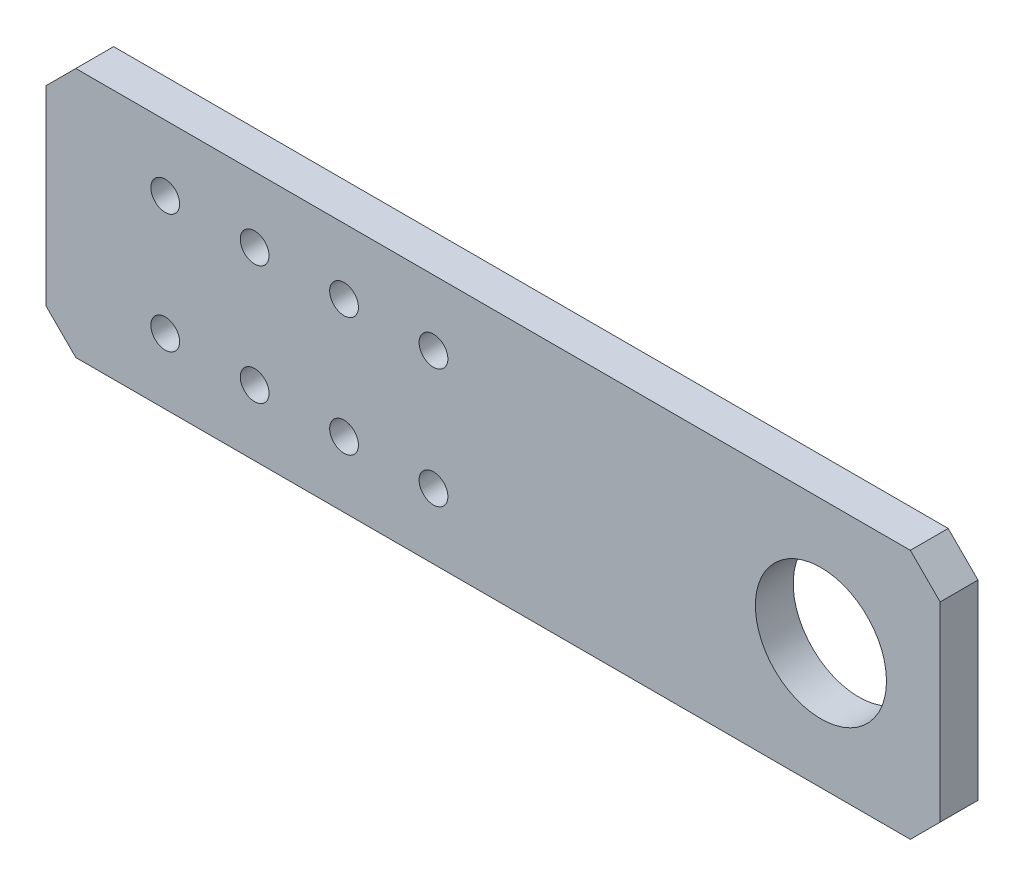
ISO-10303-21;
HEADER;
FILE_DESCRIPTION(('STEP AP214'),'2;1');
FILE_NAME('part.step','',(''),(''),'','','');
FILE_SCHEMA(('AUTOMOTIVE_DESIGN { 1 0 10303 214 1 1 1 1 }'));
ENDSEC;
DATA;
#1=APPLICATION_CONTEXT('core data for automotive mechanical design processes');
#2=APPLICATION_PROTOCOL_DEFINITION('international standard','automotive_design',2000,#1);
#3=PRODUCT_CONTEXT('',#1,'mechanical');
#4=PRODUCT('Part','Part','',(#3));
#5=PRODUCT_RELATED_PRODUCT_CATEGORY('part','',(#4));
#6=PRODUCT_DEFINITION_FORMATION('','',#4);
#7=PRODUCT_DEFINITION_CONTEXT('part definition',#1,'design');
#8=PRODUCT_DEFINITION('design','',#6,#7);
#9=PRODUCT_DEFINITION_SHAPE('','',#8);
#10=(LENGTH_UNIT() NAMED_UNIT(*) SI_UNIT(.MILLI.,.METRE.));
#11=(NAMED_UNIT(*) PLANE_ANGLE_UNIT() SI_UNIT($,.RADIAN.));
#12=(NAMED_UNIT(*) SI_UNIT($,.STERADIAN.) SOLID_ANGLE_UNIT());
#13=UNCERTAINTY_MEASURE_WITH_UNIT(LENGTH_MEASURE(1.E-05),#10,'distance_accuracy_value','');
#14=(GEOMETRIC_REPRESENTATION_CONTEXT(3) GLOBAL_UNCERTAINTY_ASSIGNED_CONTEXT((#13)) GLOBAL_UNIT_ASSIGNED_CONTEXT((#10,
#11,#12)) REPRESENTATION_CONTEXT('',''));
#15=CARTESIAN_POINT('',(0.,0.,0.));
#16=DIRECTION('',(0.,0.,1.));
#17=DIRECTION('',(1.,0.,0.));
#18=AXIS2_PLACEMENT_3D('',#15,#16,#17);
#19=CARTESIAN_POINT('',(-102.5,21.,6.35));
#20=DIRECTION('',(0.,-1.,0.));
#21=DIRECTION('',(0.,0.,-1.));
#22=AXIS2_PLACEMENT_3D('',#19,#20,#21);
#23=PLANE('',#22);
#24=DIRECTION('',(0.,0.,1.));
#25=VECTOR('',#24,1.);
#26=CARTESIAN_POINT('',(-42.5,21.,-3.65));
#27=LINE('',#26,#25);
#28=CARTESIAN_POINT('',(-42.5,21.,0.));
#29=VERTEX_POINT('',#28);
#30=CARTESIAN_POINT('',(-42.5,21.,6.35));
#31=VERTEX_POINT('',#30);
#32=EDGE_CURVE('E121',#29,#31,#27,.T.);
#33=ORIENTED_EDGE('',*,*,#32,.T.);
#34=DIRECTION('',(-1.,0.,0.));
#35=VECTOR('',#34,1.);
#36=CARTESIAN_POINT('',(-102.5,21.,6.35));
#37=LINE('',#36,#35);
#38=CARTESIAN_POINT('',(97.5,21.,6.35));
#39=VERTEX_POINT('',#38);
#40=EDGE_CURVE('E159',#39,#31,#37,.T.);
#41=ORIENTED_EDGE('',*,*,#40,.F.);
#42=DIRECTION('',(0.,0.,-1.));
#43=VECTOR('',#42,1.);
#44=CARTESIAN_POINT('',(97.5,21.,6.35));
#45=LINE('',#44,#43);
#46=CARTESIAN_POINT('',(97.5,21.,0.));
#47=VERTEX_POINT('',#46);
#48=EDGE_CURVE('E174',#39,#47,#45,.T.);
#49=ORIENTED_EDGE('',*,*,#48,.T.);
#50=DIRECTION('',(-1.,0.,0.));
#51=VECTOR('',#50,1.);
#52=CARTESIAN_POINT('',(-102.5,21.,0.));
#53=LINE('',#52,#51);
#54=EDGE_CURVE('E166',#47,#29,#53,.T.);
#55=ORIENTED_EDGE('',*,*,#54,.T.);
#56=EDGE_LOOP('',(#33,#41,#49,#55));
#57=FACE_BOUND('',#56,.T.);
#58=ADVANCED_FACE('F33',(#57),#23,.F.);
#59=CARTESIAN_POINT('',(-102.5,-21.,6.35));
#60=DIRECTION('',(0.,1.,0.));
#61=DIRECTION('',(0.,0.,1.));
#62=AXIS2_PLACEMENT_3D('',#59,#60,#61);
#63=PLANE('',#62);
#64=DIRECTION('',(0.,0.,1.));
#65=VECTOR('',#64,1.);
#66=CARTESIAN_POINT('',(-42.5,-21.,-3.65));
#67=LINE('',#66,#65);
#68=CARTESIAN_POINT('',(-42.5,-21.,0.));
#69=VERTEX_POINT('',#68);
#70=CARTESIAN_POINT('',(-42.5,-21.,6.35));
#71=VERTEX_POINT('',#70);
#72=EDGE_CURVE('E111',#69,#71,#67,.T.);
#73=ORIENTED_EDGE('',*,*,#72,.F.);
#74=DIRECTION('',(1.,0.,0.));
#75=VECTOR('',#74,1.);
#76=CARTESIAN_POINT('',(-102.5,-21.,0.));
#77=LINE('',#76,#75);
#78=CARTESIAN_POINT('',(97.4999999999999,-21.,0.));
#79=VERTEX_POINT('',#78);
#80=EDGE_CURVE('E160',#69,#79,#77,.T.);
#81=ORIENTED_EDGE('',*,*,#80,.T.);
#82=DIRECTION('',(0.,0.,1.));
#83=VECTOR('',#82,1.);
#84=CARTESIAN_POINT('',(97.5,-21.,6.35));
#85=LINE('',#84,#83);
#86=CARTESIAN_POINT('',(97.4999999999999,-21.,6.35));
#87=VERTEX_POINT('',#86);
#88=EDGE_CURVE('E181',#79,#87,#85,.T.);
#89=ORIENTED_EDGE('',*,*,#88,.T.);
#90=DIRECTION('',(1.,0.,0.));
#91=VECTOR('',#90,1.);
#92=CARTESIAN_POINT('',(-102.5,-21.,6.35));
#93=LINE('',#92,#91);
#94=EDGE_CURVE('E56',#71,#87,#93,.T.);
#95=ORIENTED_EDGE('',*,*,#94,.F.);
#96=EDGE_LOOP('',(#73,#81,#89,#95));
#97=FACE_BOUND('',#96,.T.);
#98=ADVANCED_FACE('F218',(#97),#63,.F.);
#99=CARTESIAN_POINT('',(0.,0.,6.35));
#100=DIRECTION('',(0.,0.,1.));
#101=DIRECTION('',(1.,0.,0.));
#102=AXIS2_PLACEMENT_3D('',#99,#100,#101);
#103=PLANE('',#102);
#104=CARTESIAN_POINT('',(-27.5,-10.,6.35));
#105=DIRECTION('',(0.,0.,1.));
#106=DIRECTION('',(1.,0.,0.));
#107=AXIS2_PLACEMENT_3D('',#104,#105,#106);
#108=CIRCLE('',#107,2.41299999999999);
#109=CARTESIAN_POINT('',(-25.087,-10.,6.35));
#110=VERTEX_POINT('',#109);
#111=EDGE_CURVE('E127',#110,#110,#108,.F.);
#112=ORIENTED_EDGE('',*,*,#111,.T.);
#113=EDGE_LOOP('',(#112));
#114=FACE_BOUND('',#113,.T.);
#115=CARTESIAN_POINT('',(17.5,-10.,6.35));
#116=DIRECTION('',(0.,0.,-1.));
#117=DIRECTION('',(-1.,0.,0.));
#118=AXIS2_PLACEMENT_3D('',#115,#116,#117);
#119=CIRCLE('',#118,2.413);
#120=CARTESIAN_POINT('',(15.087,-10.,6.35));
#121=VERTEX_POINT('',#120);
#122=EDGE_CURVE('E137',#121,#121,#119,.T.);
#123=ORIENTED_EDGE('',*,*,#122,.T.);
#124=EDGE_LOOP('',(#123));
#125=FACE_BOUND('',#124,.T.);
#126=CARTESIAN_POINT('',(82.5,0.,6.35));
#127=DIRECTION('',(0.,0.,1.));
#128=DIRECTION('',(1.,0.,0.));
#129=AXIS2_PLACEMENT_3D('',#126,#127,#128);
#130=CIRCLE('',#129,11.);
#131=CARTESIAN_POINT('',(93.5,0.,6.35));
#132=VERTEX_POINT('',#131);
#133=EDGE_CURVE('E152',#132,#132,#130,.T.);
#134=ORIENTED_EDGE('',*,*,#133,.F.);
#135=EDGE_LOOP('',(#134));
#136=FACE_BOUND('',#135,.T.);
#137=CARTESIAN_POINT('',(17.5,10.,6.35));
#138=DIRECTION('',(0.,0.,1.));
#139=DIRECTION('',(1.,0.,0.));
#140=AXIS2_PLACEMENT_3D('',#137,#138,#139);
#141=CIRCLE('',#140,2.413);
#142=CARTESIAN_POINT('',(19.913,10.,6.35));
#143=VERTEX_POINT('',#142);
#144=EDGE_CURVE('E136',#143,#143,#141,.T.);
#145=ORIENTED_EDGE('',*,*,#144,.F.);
#146=EDGE_LOOP('',(#145));
#147=FACE_BOUND('',#146,.T.);
#148=CARTESIAN_POINT('',(2.5,-10.,6.35));
#149=DIRECTION('',(0.,0.,-1.));
#150=DIRECTION('',(-1.,0.,0.));
#151=AXIS2_PLACEMENT_3D('',#148,#149,#150);
#152=CIRCLE('',#151,2.413);
#153=CARTESIAN_POINT('',(0.0870000000000055,-10.,6.35));
#154=VERTEX_POINT('',#153);
#155=EDGE_CURVE('E140',#154,#154,#152,.T.);
#156=ORIENTED_EDGE('',*,*,#155,.T.);
#157=EDGE_LOOP('',(#156));
#158=FACE_BOUND('',#157,.T.);
#159=CARTESIAN_POINT('',(2.5,10.,6.35));
#160=DIRECTION('',(0.,0.,1.));
#161=DIRECTION('',(1.,0.,0.));
#162=AXIS2_PLACEMENT_3D('',#159,#160,#161);
#163=CIRCLE('',#162,2.41299999999999);
#164=CARTESIAN_POINT('',(4.91299999999999,10.,6.35));
#165=VERTEX_POINT('',#164);
#166=EDGE_CURVE('E141',#165,#165,#163,.T.);
#167=ORIENTED_EDGE('',*,*,#166,.F.);
#168=EDGE_LOOP('',(#167));
#169=FACE_BOUND('',#168,.T.);
#170=CARTESIAN_POINT('',(-12.5,10.,6.35));
#171=DIRECTION('',(0.,0.,1.));
#172=DIRECTION('',(1.,0.,0.));
#173=AXIS2_PLACEMENT_3D('',#170,#171,#172);
#174=CIRCLE('',#173,2.413);
#175=CARTESIAN_POINT('',(-10.087,10.,6.35));
#176=VERTEX_POINT('',#175);
#177=EDGE_CURVE('E133',#176,#176,#174,.T.);
#178=ORIENTED_EDGE('',*,*,#177,.F.);
#179=EDGE_LOOP('',(#178));
#180=FACE_BOUND('',#179,.T.);
#181=CARTESIAN_POINT('',(-12.5,-10.,6.35));
#182=DIRECTION('',(0.,0.,1.));
#183=DIRECTION('',(1.,0.,0.));
#184=AXIS2_PLACEMENT_3D('',#181,#182,#183);
#185=CIRCLE('',#184,2.413);
#186=CARTESIAN_POINT('',(-10.087,-10.,6.35));
#187=VERTEX_POINT('',#186);
#188=EDGE_CURVE('E130',#187,#187,#185,.F.);
#189=ORIENTED_EDGE('',*,*,#188,.T.);
#190=EDGE_LOOP('',(#189));
#191=FACE_BOUND('',#190,.T.);
#192=CARTESIAN_POINT('',(-27.5,10.,6.35));
#193=DIRECTION('',(0.,0.,1.));
#194=DIRECTION('',(1.,0.,0.));
#195=AXIS2_PLACEMENT_3D('',#192,#193,#194);
#196=CIRCLE('',#195,2.41299999999999);
#197=CARTESIAN_POINT('',(-25.087,10.,6.35));
#198=VERTEX_POINT('',#197);
#199=EDGE_CURVE('E112',#198,#198,#196,.T.);
#200=ORIENTED_EDGE('',*,*,#199,.F.);
#201=EDGE_LOOP('',(#200));
#202=FACE_BOUND('',#201,.T.);
#203=DIRECTION('',(0.,-1.,0.));
#204=VECTOR('',#203,1.);
#205=CARTESIAN_POINT('',(-47.5,0.,6.35));
#206=LINE('',#205,#204);
#207=CARTESIAN_POINT('',(-47.5,16.,6.35));
#208=VERTEX_POINT('',#207);
#209=CARTESIAN_POINT('',(-47.5,-16.,6.35));
#210=VERTEX_POINT('',#209);
#211=EDGE_CURVE('E100',#208,#210,#206,.T.);
#212=ORIENTED_EDGE('',*,*,#211,.T.);
#213=DIRECTION('',(0.707106781186547,-0.707106781186548,0.));
#214=VECTOR('',#213,1.);
#215=CARTESIAN_POINT('',(-31.75,-31.75,6.35));
#216=LINE('',#215,#214);
#217=EDGE_CURVE('E108',#210,#71,#216,.T.);
#218=ORIENTED_EDGE('',*,*,#217,.T.);
#219=ORIENTED_EDGE('',*,*,#94,.T.);
#220=DIRECTION('',(-0.707106781186548,-0.707106781186548,0.));
#221=VECTOR('',#220,1.);
#222=CARTESIAN_POINT('',(59.25,-59.25,6.35));
#223=LINE('',#222,#221);
#224=CARTESIAN_POINT('',(102.5,-16.,6.35));
#225=VERTEX_POINT('',#224);
#226=EDGE_CURVE('E177',#87,#225,#223,.F.);
#227=ORIENTED_EDGE('',*,*,#226,.T.);
#228=DIRECTION('',(0.,1.,0.));
#229=VECTOR('',#228,1.);
#230=CARTESIAN_POINT('',(102.5,21.,6.35));
#231=LINE('',#230,#229);
#232=CARTESIAN_POINT('',(102.5,16.,6.35));
#233=VERTEX_POINT('',#232);
#234=EDGE_CURVE('E156',#225,#233,#231,.T.);
#235=ORIENTED_EDGE('',*,*,#234,.T.);
#236=DIRECTION('',(0.707106781186548,-0.707106781186548,0.));
#237=VECTOR('',#236,1.);
#238=CARTESIAN_POINT('',(59.25,59.25,6.35));
#239=LINE('',#238,#237);
#240=EDGE_CURVE('E179',#233,#39,#239,.F.);
#241=ORIENTED_EDGE('',*,*,#240,.T.);
#242=ORIENTED_EDGE('',*,*,#40,.T.);
#243=DIRECTION('',(-0.707106781186548,-0.707106781186548,0.));
#244=VECTOR('',#243,1.);
#245=CARTESIAN_POINT('',(-31.75,31.75,6.35));
#246=LINE('',#245,#244);
#247=EDGE_CURVE('E106',#31,#208,#246,.T.);
#248=ORIENTED_EDGE('',*,*,#247,.T.);
#249=EDGE_LOOP('',(#212,#218,#219,#227,#235,#241,#242,#248));
#250=FACE_BOUND('',#249,.T.);
#251=ADVANCED_FACE('F114',(#114,#125,#136,#147,#158,#169,#180,#191,#202,#250),#103,.T.);
#252=CARTESIAN_POINT('',(0.,0.,0.));
#253=DIRECTION('',(0.,0.,1.));
#254=DIRECTION('',(1.,0.,0.));
#255=AXIS2_PLACEMENT_3D('',#252,#253,#254);
#256=PLANE('',#255);
#257=CARTESIAN_POINT('',(-27.5,-10.,0.));
#258=DIRECTION('',(0.,0.,1.));
#259=DIRECTION('',(1.,0.,0.));
#260=AXIS2_PLACEMENT_3D('',#257,#258,#259);
#261=CIRCLE('',#260,2.41299999999999);
#262=CARTESIAN_POINT('',(-25.087,-10.,0.));
#263=VERTEX_POINT('',#262);
#264=EDGE_CURVE('E205',#263,#263,#261,.F.);
#265=ORIENTED_EDGE('',*,*,#264,.F.);
#266=EDGE_LOOP('',(#265));
#267=FACE_BOUND('',#266,.T.);
#268=CARTESIAN_POINT('',(-12.5,-10.,0.));
#269=DIRECTION('',(0.,0.,1.));
#270=DIRECTION('',(1.,0.,0.));
#271=AXIS2_PLACEMENT_3D('',#268,#269,#270);
#272=CIRCLE('',#271,2.413);
#273=CARTESIAN_POINT('',(-10.087,-10.,0.));
#274=VERTEX_POINT('',#273);
#275=EDGE_CURVE('E202',#274,#274,#272,.F.);
#276=ORIENTED_EDGE('',*,*,#275,.F.);
#277=EDGE_LOOP('',(#276));
#278=FACE_BOUND('',#277,.T.);
#279=CARTESIAN_POINT('',(17.5,-10.,0.));
#280=DIRECTION('',(0.,0.,1.));
#281=DIRECTION('',(1.,0.,0.));
#282=AXIS2_PLACEMENT_3D('',#279,#280,#281);
#283=CIRCLE('',#282,2.413);
#284=CARTESIAN_POINT('',(19.913,-10.,0.));
#285=VERTEX_POINT('',#284);
#286=EDGE_CURVE('E193',#285,#285,#283,.F.);
#287=ORIENTED_EDGE('',*,*,#286,.F.);
#288=EDGE_LOOP('',(#287));
#289=FACE_BOUND('',#288,.T.);
#290=CARTESIAN_POINT('',(2.5,-10.,0.));
#291=DIRECTION('',(0.,0.,1.));
#292=DIRECTION('',(1.,0.,0.));
#293=AXIS2_PLACEMENT_3D('',#290,#291,#292);
#294=CIRCLE('',#293,2.413);
#295=CARTESIAN_POINT('',(4.913,-10.,0.));
#296=VERTEX_POINT('',#295);
#297=EDGE_CURVE('E190',#296,#296,#294,.F.);
#298=ORIENTED_EDGE('',*,*,#297,.F.);
#299=EDGE_LOOP('',(#298));
#300=FACE_BOUND('',#299,.T.);
#301=CARTESIAN_POINT('',(82.5,0.,0.));
#302=DIRECTION('',(0.,0.,1.));
#303=DIRECTION('',(1.,0.,0.));
#304=AXIS2_PLACEMENT_3D('',#301,#302,#303);
#305=CIRCLE('',#304,11.);
#306=CARTESIAN_POINT('',(93.5,0.,0.));
#307=VERTEX_POINT('',#306);
#308=EDGE_CURVE('E148',#307,#307,#305,.T.);
#309=ORIENTED_EDGE('',*,*,#308,.T.);
#310=EDGE_LOOP('',(#309));
#311=FACE_BOUND('',#310,.T.);
#312=CARTESIAN_POINT('',(17.5,10.,0.));
#313=DIRECTION('',(0.,0.,1.));
#314=DIRECTION('',(1.,0.,0.));
#315=AXIS2_PLACEMENT_3D('',#312,#313,#314);
#316=CIRCLE('',#315,2.413);
#317=CARTESIAN_POINT('',(19.913,10.,0.));
#318=VERTEX_POINT('',#317);
#319=EDGE_CURVE('E120',#318,#318,#316,.T.);
#320=ORIENTED_EDGE('',*,*,#319,.T.);
#321=EDGE_LOOP('',(#320));
#322=FACE_BOUND('',#321,.T.);
#323=CARTESIAN_POINT('',(2.5,10.,0.));
#324=DIRECTION('',(0.,0.,1.));
#325=DIRECTION('',(1.,0.,0.));
#326=AXIS2_PLACEMENT_3D('',#323,#324,#325);
#327=CIRCLE('',#326,2.41299999999999);
#328=CARTESIAN_POINT('',(4.91299999999999,10.,0.));
#329=VERTEX_POINT('',#328);
#330=EDGE_CURVE('E196',#329,#329,#327,.T.);
#331=ORIENTED_EDGE('',*,*,#330,.T.);
#332=EDGE_LOOP('',(#331));
#333=FACE_BOUND('',#332,.T.);
#334=CARTESIAN_POINT('',(-12.5,10.,0.));
#335=DIRECTION('',(0.,0.,1.));
#336=DIRECTION('',(1.,0.,0.));
#337=AXIS2_PLACEMENT_3D('',#334,#335,#336);
#338=CIRCLE('',#337,2.413);
#339=CARTESIAN_POINT('',(-10.087,10.,0.));
#340=VERTEX_POINT('',#339);
#341=EDGE_CURVE('E199',#340,#340,#338,.T.);
#342=ORIENTED_EDGE('',*,*,#341,.T.);
#343=EDGE_LOOP('',(#342));
#344=FACE_BOUND('',#343,.T.);
#345=CARTESIAN_POINT('',(-27.5,10.,0.));
#346=DIRECTION('',(0.,0.,1.));
#347=DIRECTION('',(1.,0.,0.));
#348=AXIS2_PLACEMENT_3D('',#345,#346,#347);
#349=CIRCLE('',#348,2.41299999999999);
#350=CARTESIAN_POINT('',(-25.087,10.,0.));
#351=VERTEX_POINT('',#350);
#352=EDGE_CURVE('E155',#351,#351,#349,.T.);
#353=ORIENTED_EDGE('',*,*,#352,.T.);
#354=EDGE_LOOP('',(#353));
#355=FACE_BOUND('',#354,.T.);
#356=DIRECTION('',(0.707106781186547,-0.707106781186548,0.));
#357=VECTOR('',#356,1.);
#358=CARTESIAN_POINT('',(-31.75,-31.75,0.));
#359=LINE('',#358,#357);
#360=CARTESIAN_POINT('',(-47.5,-16.,0.));
#361=VERTEX_POINT('',#360);
#362=EDGE_CURVE('E11',#361,#69,#359,.T.);
#363=ORIENTED_EDGE('',*,*,#362,.F.);
#364=DIRECTION('',(0.,-1.,0.));
#365=VECTOR('',#364,1.);
#366=CARTESIAN_POINT('',(-47.5,0.,0.));
#367=LINE('',#366,#365);
#368=CARTESIAN_POINT('',(-47.5,16.,0.));
#369=VERTEX_POINT('',#368);
#370=EDGE_CURVE('E103',#369,#361,#367,.T.);
#371=ORIENTED_EDGE('',*,*,#370,.F.);
#372=DIRECTION('',(-0.707106781186548,-0.707106781186548,0.));
#373=VECTOR('',#372,1.);
#374=CARTESIAN_POINT('',(-31.75,31.75,0.));
#375=LINE('',#374,#373);
#376=EDGE_CURVE('E41',#29,#369,#375,.T.);
#377=ORIENTED_EDGE('',*,*,#376,.F.);
#378=ORIENTED_EDGE('',*,*,#54,.F.);
#379=DIRECTION('',(-0.707106781186548,0.707106781186548,0.));
#380=VECTOR('',#379,1.);
#381=CARTESIAN_POINT('',(97.5,21.,0.));
#382=LINE('',#381,#380);
#383=CARTESIAN_POINT('',(102.5,16.,0.));
#384=VERTEX_POINT('',#383);
#385=EDGE_CURVE('E172',#47,#384,#382,.F.);
#386=ORIENTED_EDGE('',*,*,#385,.T.);
#387=DIRECTION('',(0.,1.,0.));
#388=VECTOR('',#387,1.);
#389=CARTESIAN_POINT('',(102.5,21.,0.));
#390=LINE('',#389,#388);
#391=CARTESIAN_POINT('',(102.5,-16.,0.));
#392=VERTEX_POINT('',#391);
#393=EDGE_CURVE('E151',#392,#384,#390,.T.);
#394=ORIENTED_EDGE('',*,*,#393,.F.);
#395=DIRECTION('',(0.707106781186548,0.707106781186548,0.));
#396=VECTOR('',#395,1.);
#397=CARTESIAN_POINT('',(102.5,-16.,0.));
#398=LINE('',#397,#396);
#399=EDGE_CURVE('E163',#392,#79,#398,.F.);
#400=ORIENTED_EDGE('',*,*,#399,.T.);
#401=ORIENTED_EDGE('',*,*,#80,.F.);
#402=EDGE_LOOP('',(#363,#371,#377,#378,#386,#394,#400,#401));
#403=FACE_BOUND('',#402,.T.);
#404=ADVANCED_FACE('F215',(#267,#278,#289,#300,#311,#322,#333,#344,#355,#403),#256,.F.);
#405=CARTESIAN_POINT('',(102.5,21.,6.35));
#406=DIRECTION('',(-1.,0.,0.));
#407=DIRECTION('',(0.,0.,1.));
#408=AXIS2_PLACEMENT_3D('',#405,#406,#407);
#409=PLANE('',#408);
#410=ORIENTED_EDGE('',*,*,#393,.T.);
#411=DIRECTION('',(0.,0.,1.));
#412=VECTOR('',#411,1.);
#413=CARTESIAN_POINT('',(102.5,16.,6.35));
#414=LINE('',#413,#412);
#415=EDGE_CURVE('E186',#384,#233,#414,.T.);
#416=ORIENTED_EDGE('',*,*,#415,.T.);
#417=ORIENTED_EDGE('',*,*,#234,.F.);
#418=DIRECTION('',(0.,0.,-1.));
#419=VECTOR('',#418,1.);
#420=CARTESIAN_POINT('',(102.5,-16.,6.35));
#421=LINE('',#420,#419);
#422=EDGE_CURVE('E183',#225,#392,#421,.T.);
#423=ORIENTED_EDGE('',*,*,#422,.T.);
#424=EDGE_LOOP('',(#410,#416,#417,#423));
#425=FACE_BOUND('',#424,.T.);
#426=ADVANCED_FACE('F226',(#425),#409,.F.);
#427=CARTESIAN_POINT('',(97.5,21.,6.35));
#428=DIRECTION('',(-0.707106781186548,-0.707106781186548,0.));
#429=DIRECTION('',(0.,0.,-1.));
#430=AXIS2_PLACEMENT_3D('',#427,#428,#429);
#431=PLANE('',#430);
#432=ORIENTED_EDGE('',*,*,#240,.F.);
#433=ORIENTED_EDGE('',*,*,#415,.F.);
#434=ORIENTED_EDGE('',*,*,#385,.F.);
#435=ORIENTED_EDGE('',*,*,#48,.F.);
#436=EDGE_LOOP('',(#432,#433,#434,#435));
#437=FACE_BOUND('',#436,.T.);
#438=ADVANCED_FACE('F230',(#437),#431,.F.);
#439=CARTESIAN_POINT('',(102.5,-16.,6.35));
#440=DIRECTION('',(-0.707106781186547,0.707106781186547,0.));
#441=DIRECTION('',(0.,0.,-1.));
#442=AXIS2_PLACEMENT_3D('',#439,#440,#441);
#443=PLANE('',#442);
#444=ORIENTED_EDGE('',*,*,#226,.F.);
#445=ORIENTED_EDGE('',*,*,#88,.F.);
#446=ORIENTED_EDGE('',*,*,#399,.F.);
#447=ORIENTED_EDGE('',*,*,#422,.F.);
#448=EDGE_LOOP('',(#444,#445,#446,#447));
#449=FACE_BOUND('',#448,.T.);
#450=ADVANCED_FACE('F35',(#449),#443,.F.);
#451=CARTESIAN_POINT('',(82.5,0.,0.));
#452=DIRECTION('',(0.,0.,1.));
#453=DIRECTION('',(1.,0.,0.));
#454=AXIS2_PLACEMENT_3D('',#451,#452,#453);
#455=CYLINDRICAL_SURFACE('',#454,11.);
#456=ORIENTED_EDGE('',*,*,#308,.F.);
#457=EDGE_LOOP('',(#456));
#458=FACE_BOUND('',#457,.T.);
#459=ORIENTED_EDGE('',*,*,#133,.T.);
#460=EDGE_LOOP('',(#459));
#461=FACE_BOUND('',#460,.T.);
#462=ADVANCED_FACE('F247',(#458,#461),#455,.F.);
#463=CARTESIAN_POINT('',(17.5,10.,-3.65));
#464=DIRECTION('',(0.,0.,1.));
#465=DIRECTION('',(1.,0.,0.));
#466=AXIS2_PLACEMENT_3D('',#463,#464,#465);
#467=CYLINDRICAL_SURFACE('',#466,2.413);
#468=ORIENTED_EDGE('',*,*,#144,.T.);
#469=EDGE_LOOP('',(#468));
#470=FACE_BOUND('',#469,.T.);
#471=ORIENTED_EDGE('',*,*,#319,.F.);
#472=EDGE_LOOP('',(#471));
#473=FACE_BOUND('',#472,.T.);
#474=ADVANCED_FACE('F251',(#470,#473),#467,.F.);
#475=CARTESIAN_POINT('',(2.5,-10.,-3.65));
#476=DIRECTION('',(0.,0.,1.));
#477=DIRECTION('',(1.,0.,0.));
#478=AXIS2_PLACEMENT_3D('',#475,#476,#477);
#479=CYLINDRICAL_SURFACE('',#478,2.413);
#480=ORIENTED_EDGE('',*,*,#155,.F.);
#481=EDGE_LOOP('',(#480));
#482=FACE_BOUND('',#481,.T.);
#483=ORIENTED_EDGE('',*,*,#297,.T.);
#484=EDGE_LOOP('',(#483));
#485=FACE_BOUND('',#484,.T.);
#486=ADVANCED_FACE('F257',(#482,#485),#479,.F.);
#487=CARTESIAN_POINT('',(17.5,-10.,-3.65));
#488=DIRECTION('',(0.,0.,1.));
#489=DIRECTION('',(1.,0.,0.));
#490=AXIS2_PLACEMENT_3D('',#487,#488,#489);
#491=CYLINDRICAL_SURFACE('',#490,2.413);
#492=ORIENTED_EDGE('',*,*,#122,.F.);
#493=EDGE_LOOP('',(#492));
#494=FACE_BOUND('',#493,.T.);
#495=ORIENTED_EDGE('',*,*,#286,.T.);
#496=EDGE_LOOP('',(#495));
#497=FACE_BOUND('',#496,.T.);
#498=ADVANCED_FACE('F310',(#494,#497),#491,.F.);
#499=CARTESIAN_POINT('',(2.5,10.,-3.65));
#500=DIRECTION('',(0.,0.,1.));
#501=DIRECTION('',(1.,0.,0.));
#502=AXIS2_PLACEMENT_3D('',#499,#500,#501);
#503=CYLINDRICAL_SURFACE('',#502,2.41299999999999);
#504=ORIENTED_EDGE('',*,*,#166,.T.);
#505=EDGE_LOOP('',(#504));
#506=FACE_BOUND('',#505,.T.);
#507=ORIENTED_EDGE('',*,*,#330,.F.);
#508=EDGE_LOOP('',(#507));
#509=FACE_BOUND('',#508,.T.);
#510=ADVANCED_FACE('F308',(#506,#509),#503,.F.);
#511=CARTESIAN_POINT('',(-12.5,10.,-3.65));
#512=DIRECTION('',(0.,0.,1.));
#513=DIRECTION('',(1.,0.,0.));
#514=AXIS2_PLACEMENT_3D('',#511,#512,#513);
#515=CYLINDRICAL_SURFACE('',#514,2.413);
#516=ORIENTED_EDGE('',*,*,#177,.T.);
#517=EDGE_LOOP('',(#516));
#518=FACE_BOUND('',#517,.T.);
#519=ORIENTED_EDGE('',*,*,#341,.F.);
#520=EDGE_LOOP('',(#519));
#521=FACE_BOUND('',#520,.T.);
#522=ADVANCED_FACE('F304',(#518,#521),#515,.F.);
#523=CARTESIAN_POINT('',(-12.5,-10.,-3.65));
#524=DIRECTION('',(0.,0.,1.));
#525=DIRECTION('',(1.,0.,0.));
#526=AXIS2_PLACEMENT_3D('',#523,#524,#525);
#527=CYLINDRICAL_SURFACE('',#526,2.413);
#528=ORIENTED_EDGE('',*,*,#188,.F.);
#529=EDGE_LOOP('',(#528));
#530=FACE_BOUND('',#529,.T.);
#531=ORIENTED_EDGE('',*,*,#275,.T.);
#532=EDGE_LOOP('',(#531));
#533=FACE_BOUND('',#532,.T.);
#534=ADVANCED_FACE('F297',(#530,#533),#527,.F.);
#535=CARTESIAN_POINT('',(-27.5,-10.,-3.65));
#536=DIRECTION('',(0.,0.,1.));
#537=DIRECTION('',(1.,0.,0.));
#538=AXIS2_PLACEMENT_3D('',#535,#536,#537);
#539=CYLINDRICAL_SURFACE('',#538,2.41299999999999);
#540=ORIENTED_EDGE('',*,*,#111,.F.);
#541=EDGE_LOOP('',(#540));
#542=FACE_BOUND('',#541,.T.);
#543=ORIENTED_EDGE('',*,*,#264,.T.);
#544=EDGE_LOOP('',(#543));
#545=FACE_BOUND('',#544,.T.);
#546=ADVANCED_FACE('F289',(#542,#545),#539,.F.);
#547=CARTESIAN_POINT('',(-27.5,10.,-3.65));
#548=DIRECTION('',(0.,0.,1.));
#549=DIRECTION('',(1.,0.,0.));
#550=AXIS2_PLACEMENT_3D('',#547,#548,#549);
#551=CYLINDRICAL_SURFACE('',#550,2.41299999999999);
#552=ORIENTED_EDGE('',*,*,#199,.T.);
#553=EDGE_LOOP('',(#552));
#554=FACE_BOUND('',#553,.T.);
#555=ORIENTED_EDGE('',*,*,#352,.F.);
#556=EDGE_LOOP('',(#555));
#557=FACE_BOUND('',#556,.T.);
#558=ADVANCED_FACE('F287',(#554,#557),#551,.F.);
#559=CARTESIAN_POINT('',(-31.75,-31.75,-3.65));
#560=DIRECTION('',(-0.707106781186548,-0.707106781186547,0.));
#561=DIRECTION('',(0.707106781186547,-0.707106781186548,0.));
#562=AXIS2_PLACEMENT_3D('',#559,#560,#561);
#563=PLANE('',#562);
#564=ORIENTED_EDGE('',*,*,#362,.T.);
#565=ORIENTED_EDGE('',*,*,#72,.T.);
#566=ORIENTED_EDGE('',*,*,#217,.F.);
#567=DIRECTION('',(0.,0.,1.));
#568=VECTOR('',#567,1.);
#569=CARTESIAN_POINT('',(-47.5,-16.,-3.65));
#570=LINE('',#569,#568);
#571=EDGE_CURVE('E96',#361,#210,#570,.T.);
#572=ORIENTED_EDGE('',*,*,#571,.F.);
#573=EDGE_LOOP('',(#564,#565,#566,#572));
#574=FACE_BOUND('',#573,.T.);
#575=ADVANCED_FACE('F109',(#574),#563,.T.);
#576=CARTESIAN_POINT('',(-31.75,31.75,-3.65));
#577=DIRECTION('',(-0.707106781186548,0.707106781186548,0.));
#578=DIRECTION('',(-0.707106781186548,-0.707106781186548,0.));
#579=AXIS2_PLACEMENT_3D('',#576,#577,#578);
#580=PLANE('',#579);
#581=ORIENTED_EDGE('',*,*,#376,.T.);
#582=DIRECTION('',(0.,0.,1.));
#583=VECTOR('',#582,1.);
#584=CARTESIAN_POINT('',(-47.5,16.,-3.65));
#585=LINE('',#584,#583);
#586=EDGE_CURVE('E48',#369,#208,#585,.T.);
#587=ORIENTED_EDGE('',*,*,#586,.T.);
#588=ORIENTED_EDGE('',*,*,#247,.F.);
#589=ORIENTED_EDGE('',*,*,#32,.F.);
#590=EDGE_LOOP('',(#581,#587,#588,#589));
#591=FACE_BOUND('',#590,.T.);
#592=ADVANCED_FACE('F212',(#591),#580,.T.);
#593=CARTESIAN_POINT('',(-47.5,0.,-3.65));
#594=DIRECTION('',(-1.,0.,0.));
#595=DIRECTION('',(0.,-1.,0.));
#596=AXIS2_PLACEMENT_3D('',#593,#594,#595);
#597=PLANE('',#596);
#598=ORIENTED_EDGE('',*,*,#370,.T.);
#599=ORIENTED_EDGE('',*,*,#571,.T.);
#600=ORIENTED_EDGE('',*,*,#211,.F.);
#601=ORIENTED_EDGE('',*,*,#586,.F.);
#602=EDGE_LOOP('',(#598,#599,#600,#601));
#603=FACE_BOUND('',#602,.T.);
#604=ADVANCED_FACE('F98',(#603),#597,.T.);
#605=CLOSED_SHELL('',(#58,#98,#251,#404,#426,#438,#450,#462,#474,#486,#498,#510,#522,#534,#546,
#558,#575,#592,#604));
#606=MANIFOLD_SOLID_BREP('B2',#605);
#607=ADVANCED_BREP_SHAPE_REPRESENTATION('',(#18,#606),#14);
#608=SHAPE_DEFINITION_REPRESENTATION(#9,#607);
ENDSEC;
END-ISO-10303-21;
